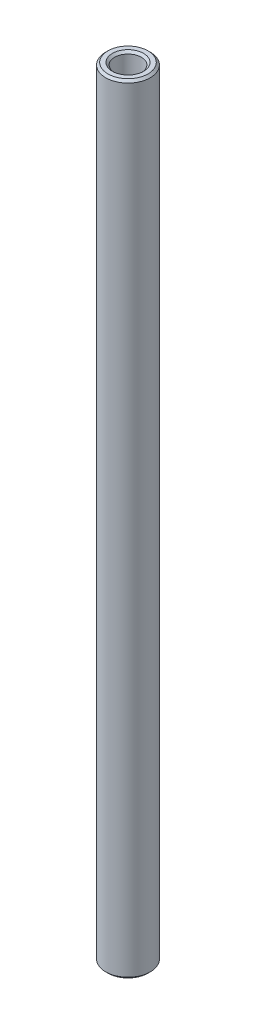
ISO-10303-21;
HEADER;
FILE_DESCRIPTION(('STEP AP214'),'2;1');
FILE_NAME('part.step','',(''),(''),'','','');
FILE_SCHEMA(('AUTOMOTIVE_DESIGN { 1 0 10303 214 1 1 1 1 }'));
ENDSEC;
DATA;
#1=APPLICATION_CONTEXT('core data for automotive mechanical design processes');
#2=APPLICATION_PROTOCOL_DEFINITION('international standard','automotive_design',2000,#1);
#3=PRODUCT_CONTEXT('',#1,'mechanical');
#4=PRODUCT('Part','Part','',(#3));
#5=PRODUCT_RELATED_PRODUCT_CATEGORY('part','',(#4));
#6=PRODUCT_DEFINITION_FORMATION('','',#4);
#7=PRODUCT_DEFINITION_CONTEXT('part definition',#1,'design');
#8=PRODUCT_DEFINITION('design','',#6,#7);
#9=PRODUCT_DEFINITION_SHAPE('','',#8);
#10=(LENGTH_UNIT() NAMED_UNIT(*) SI_UNIT(.MILLI.,.METRE.));
#11=(NAMED_UNIT(*) PLANE_ANGLE_UNIT() SI_UNIT($,.RADIAN.));
#12=(NAMED_UNIT(*) SI_UNIT($,.STERADIAN.) SOLID_ANGLE_UNIT());
#13=UNCERTAINTY_MEASURE_WITH_UNIT(LENGTH_MEASURE(1.E-05),#10,'distance_accuracy_value','');
#14=(GEOMETRIC_REPRESENTATION_CONTEXT(3) GLOBAL_UNCERTAINTY_ASSIGNED_CONTEXT((#13)) GLOBAL_UNIT_ASSIGNED_CONTEXT((#10,
#11,#12)) REPRESENTATION_CONTEXT('',''));
#15=CARTESIAN_POINT('',(0.,0.,0.));
#16=DIRECTION('',(0.,0.,1.));
#17=DIRECTION('',(1.,0.,0.));
#18=AXIS2_PLACEMENT_3D('',#15,#16,#17);
#19=CARTESIAN_POINT('',(0.,175.,0.));
#20=DIRECTION('',(0.,1.,0.));
#21=DIRECTION('',(0.,0.,1.));
#22=AXIS2_PLACEMENT_3D('',#19,#20,#21);
#23=PLANE('',#22);
#24=CARTESIAN_POINT('',(0.,175.,0.));
#25=DIRECTION('',(0.,1.,0.));
#26=DIRECTION('',(0.,0.,1.));
#27=AXIS2_PLACEMENT_3D('',#24,#25,#26);
#28=CIRCLE('',#27,4.49999999999999);
#29=CARTESIAN_POINT('',(0.,175.,4.49999999999999));
#30=VERTEX_POINT('',#29);
#31=EDGE_CURVE('E64',#30,#30,#28,.T.);
#32=ORIENTED_EDGE('',*,*,#31,.T.);
#33=EDGE_LOOP('',(#32));
#34=FACE_BOUND('',#33,.T.);
#35=CARTESIAN_POINT('',(0.,175.,0.));
#36=DIRECTION('',(0.,1.,0.));
#37=DIRECTION('',(0.,0.,1.));
#38=AXIS2_PLACEMENT_3D('',#35,#36,#37);
#39=CIRCLE('',#38,3.5);
#40=CARTESIAN_POINT('',(0.,175.,3.5));
#41=VERTEX_POINT('',#40);
#42=EDGE_CURVE('E68',#41,#41,#39,.F.);
#43=ORIENTED_EDGE('',*,*,#42,.T.);
#44=EDGE_LOOP('',(#43));
#45=FACE_BOUND('',#44,.T.);
#46=ADVANCED_FACE('F34',(#34,#45),#23,.T.);
#47=CARTESIAN_POINT('',(0.,155.,0.));
#48=DIRECTION('',(0.,1.,0.));
#49=DIRECTION('',(0.,0.,1.));
#50=AXIS2_PLACEMENT_3D('',#47,#48,#49);
#51=CYLINDRICAL_SURFACE('',#50,3.);
#52=CARTESIAN_POINT('',(0.,174.5,0.));
#53=DIRECTION('',(0.,1.,0.));
#54=DIRECTION('',(0.,0.,1.));
#55=AXIS2_PLACEMENT_3D('',#52,#53,#54);
#56=CIRCLE('',#55,3.);
#57=CARTESIAN_POINT('',(0.,174.5,3.));
#58=VERTEX_POINT('',#57);
#59=EDGE_CURVE('E72',#58,#58,#56,.T.);
#60=ORIENTED_EDGE('',*,*,#59,.T.);
#61=EDGE_LOOP('',(#60));
#62=FACE_BOUND('',#61,.T.);
#63=CARTESIAN_POINT('',(0.,155.,0.));
#64=DIRECTION('',(0.,1.,0.));
#65=DIRECTION('',(0.,0.,1.));
#66=AXIS2_PLACEMENT_3D('',#63,#64,#65);
#67=CIRCLE('',#66,3.);
#68=CARTESIAN_POINT('',(0.,155.,3.));
#69=VERTEX_POINT('',#68);
#70=EDGE_CURVE('E76',#69,#69,#67,.T.);
#71=ORIENTED_EDGE('',*,*,#70,.F.);
#72=EDGE_LOOP('',(#71));
#73=FACE_BOUND('',#72,.T.);
#74=ADVANCED_FACE('F103',(#62,#73),#51,.F.);
#75=CARTESIAN_POINT('',(0.,155.,0.));
#76=DIRECTION('',(0.,1.,0.));
#77=DIRECTION('',(0.,0.,1.));
#78=AXIS2_PLACEMENT_3D('',#75,#76,#77);
#79=PLANE('',#78);
#80=ORIENTED_EDGE('',*,*,#70,.T.);
#81=EDGE_LOOP('',(#80));
#82=FACE_BOUND('',#81,.T.);
#83=ADVANCED_FACE('F109',(#82),#79,.T.);
#84=CARTESIAN_POINT('',(0.,174.5,0.));
#85=DIRECTION('',(0.,1.,0.));
#86=DIRECTION('',(0.,0.,1.));
#87=AXIS2_PLACEMENT_3D('',#84,#85,#86);
#88=CONICAL_SURFACE('',#87,3.,0.78539816339745);
#89=ORIENTED_EDGE('',*,*,#42,.F.);
#90=EDGE_LOOP('',(#89));
#91=FACE_BOUND('',#90,.T.);
#92=ORIENTED_EDGE('',*,*,#59,.F.);
#93=EDGE_LOOP('',(#92));
#94=FACE_BOUND('',#93,.T.);
#95=ADVANCED_FACE('F114',(#91,#94),#88,.F.);
#96=CARTESIAN_POINT('',(0.,273.,0.));
#97=DIRECTION('',(0.,-1.,0.));
#98=DIRECTION('',(0.,0.,-1.));
#99=AXIS2_PLACEMENT_3D('',#96,#97,#98);
#100=CYLINDRICAL_SURFACE('',#99,5.);
#101=CARTESIAN_POINT('',(0.,174.5,0.));
#102=DIRECTION('',(0.,1.,0.));
#103=DIRECTION('',(0.,0.,1.));
#104=AXIS2_PLACEMENT_3D('',#101,#102,#103);
#105=CIRCLE('',#104,5.);
#106=CARTESIAN_POINT('',(0.,174.5,5.));
#107=VERTEX_POINT('',#106);
#108=EDGE_CURVE('E54',#107,#107,#105,.F.);
#109=ORIENTED_EDGE('',*,*,#108,.T.);
#110=EDGE_LOOP('',(#109));
#111=FACE_BOUND('',#110,.T.);
#112=CARTESIAN_POINT('',(0.,0.5,0.));
#113=DIRECTION('',(0.,1.,0.));
#114=DIRECTION('',(0.,0.,1.));
#115=AXIS2_PLACEMENT_3D('',#112,#113,#114);
#116=CIRCLE('',#115,5.);
#117=CARTESIAN_POINT('',(0.,0.5,5.));
#118=VERTEX_POINT('',#117);
#119=EDGE_CURVE('E60',#118,#118,#116,.T.);
#120=ORIENTED_EDGE('',*,*,#119,.T.);
#121=EDGE_LOOP('',(#120));
#122=FACE_BOUND('',#121,.T.);
#123=ADVANCED_FACE('F99',(#111,#122),#100,.T.);
#124=CARTESIAN_POINT('',(0.,20.,0.));
#125=DIRECTION('',(0.,-1.,0.));
#126=DIRECTION('',(0.,0.,-1.));
#127=AXIS2_PLACEMENT_3D('',#124,#125,#126);
#128=PLANE('',#127);
#129=CARTESIAN_POINT('',(0.,20.,0.));
#130=DIRECTION('',(0.,-1.,0.));
#131=DIRECTION('',(0.,0.,-1.));
#132=AXIS2_PLACEMENT_3D('',#129,#130,#131);
#133=CIRCLE('',#132,3.);
#134=CARTESIAN_POINT('',(0.,20.,-3.));
#135=VERTEX_POINT('',#134);
#136=EDGE_CURVE('E80',#135,#135,#133,.T.);
#137=ORIENTED_EDGE('',*,*,#136,.T.);
#138=EDGE_LOOP('',(#137));
#139=FACE_BOUND('',#138,.T.);
#140=ADVANCED_FACE('F86',(#139),#128,.T.);
#141=CARTESIAN_POINT('',(0.,20.,0.));
#142=DIRECTION('',(0.,-1.,0.));
#143=DIRECTION('',(0.,0.,-1.));
#144=AXIS2_PLACEMENT_3D('',#141,#142,#143);
#145=CYLINDRICAL_SURFACE('',#144,3.);
#146=CARTESIAN_POINT('',(0.,0.500000000000028,0.));
#147=DIRECTION('',(0.,1.,0.));
#148=DIRECTION('',(0.,0.,1.));
#149=AXIS2_PLACEMENT_3D('',#146,#147,#148);
#150=CIRCLE('',#149,3.);
#151=CARTESIAN_POINT('',(0.,0.500000000000028,3.));
#152=VERTEX_POINT('',#151);
#153=EDGE_CURVE('E48',#152,#152,#150,.F.);
#154=ORIENTED_EDGE('',*,*,#153,.T.);
#155=EDGE_LOOP('',(#154));
#156=FACE_BOUND('',#155,.T.);
#157=ORIENTED_EDGE('',*,*,#136,.F.);
#158=EDGE_LOOP('',(#157));
#159=FACE_BOUND('',#158,.T.);
#160=ADVANCED_FACE('F88',(#156,#159),#145,.F.);
#161=CARTESIAN_POINT('',(0.,0.,0.));
#162=DIRECTION('',(0.,1.,0.));
#163=DIRECTION('',(0.,0.,1.));
#164=AXIS2_PLACEMENT_3D('',#161,#162,#163);
#165=PLANE('',#164);
#166=CARTESIAN_POINT('',(0.,0.,0.));
#167=DIRECTION('',(0.,1.,0.));
#168=DIRECTION('',(0.,0.,1.));
#169=AXIS2_PLACEMENT_3D('',#166,#167,#168);
#170=CIRCLE('',#169,3.5);
#171=CARTESIAN_POINT('',(0.,0.,3.5));
#172=VERTEX_POINT('',#171);
#173=EDGE_CURVE('E10',#172,#172,#170,.T.);
#174=ORIENTED_EDGE('',*,*,#173,.T.);
#175=EDGE_LOOP('',(#174));
#176=FACE_BOUND('',#175,.T.);
#177=CARTESIAN_POINT('',(0.,0.,0.));
#178=DIRECTION('',(0.,1.,0.));
#179=DIRECTION('',(0.,0.,1.));
#180=AXIS2_PLACEMENT_3D('',#177,#178,#179);
#181=CIRCLE('',#180,4.49999999999999);
#182=CARTESIAN_POINT('',(0.,0.,4.49999999999999));
#183=VERTEX_POINT('',#182);
#184=EDGE_CURVE('E42',#183,#183,#181,.F.);
#185=ORIENTED_EDGE('',*,*,#184,.T.);
#186=EDGE_LOOP('',(#185));
#187=FACE_BOUND('',#186,.T.);
#188=ADVANCED_FACE('F90',(#176,#187),#165,.F.);
#189=CARTESIAN_POINT('',(0.,175.,0.));
#190=DIRECTION('',(0.,-1.,0.));
#191=DIRECTION('',(0.,0.,-1.));
#192=AXIS2_PLACEMENT_3D('',#189,#190,#191);
#193=CONICAL_SURFACE('',#192,4.49999999999999,0.785398163397458);
#194=ORIENTED_EDGE('',*,*,#108,.F.);
#195=EDGE_LOOP('',(#194));
#196=FACE_BOUND('',#195,.T.);
#197=ORIENTED_EDGE('',*,*,#31,.F.);
#198=EDGE_LOOP('',(#197));
#199=FACE_BOUND('',#198,.T.);
#200=ADVANCED_FACE('F97',(#196,#199),#193,.T.);
#201=CARTESIAN_POINT('',(0.,0.500000000000028,0.));
#202=DIRECTION('',(0.,-1.,0.));
#203=DIRECTION('',(0.,0.,-1.));
#204=AXIS2_PLACEMENT_3D('',#201,#202,#203);
#205=CONICAL_SURFACE('',#204,3.,0.785398163397423);
#206=ORIENTED_EDGE('',*,*,#173,.F.);
#207=EDGE_LOOP('',(#206));
#208=FACE_BOUND('',#207,.T.);
#209=ORIENTED_EDGE('',*,*,#153,.F.);
#210=EDGE_LOOP('',(#209));
#211=FACE_BOUND('',#210,.T.);
#212=ADVANCED_FACE('F119',(#208,#211),#205,.F.);
#213=CARTESIAN_POINT('',(0.,0.,0.));
#214=DIRECTION('',(0.,1.,0.));
#215=DIRECTION('',(0.,0.,1.));
#216=AXIS2_PLACEMENT_3D('',#213,#214,#215);
#217=CONICAL_SURFACE('',#216,4.49999999999999,0.785398163397458);
#218=ORIENTED_EDGE('',*,*,#119,.F.);
#219=EDGE_LOOP('',(#218));
#220=FACE_BOUND('',#219,.T.);
#221=ORIENTED_EDGE('',*,*,#184,.F.);
#222=EDGE_LOOP('',(#221));
#223=FACE_BOUND('',#222,.T.);
#224=ADVANCED_FACE('F36',(#220,#223),#217,.T.);
#225=CLOSED_SHELL('',(#46,#74,#83,#95,#123,#140,#160,#188,#200,#212,#224));
#226=MANIFOLD_SOLID_BREP('B2',#225);
#227=ADVANCED_BREP_SHAPE_REPRESENTATION('',(#18,#226),#14);
#228=SHAPE_DEFINITION_REPRESENTATION(#9,#227);
ENDSEC;
END-ISO-10303-21;
